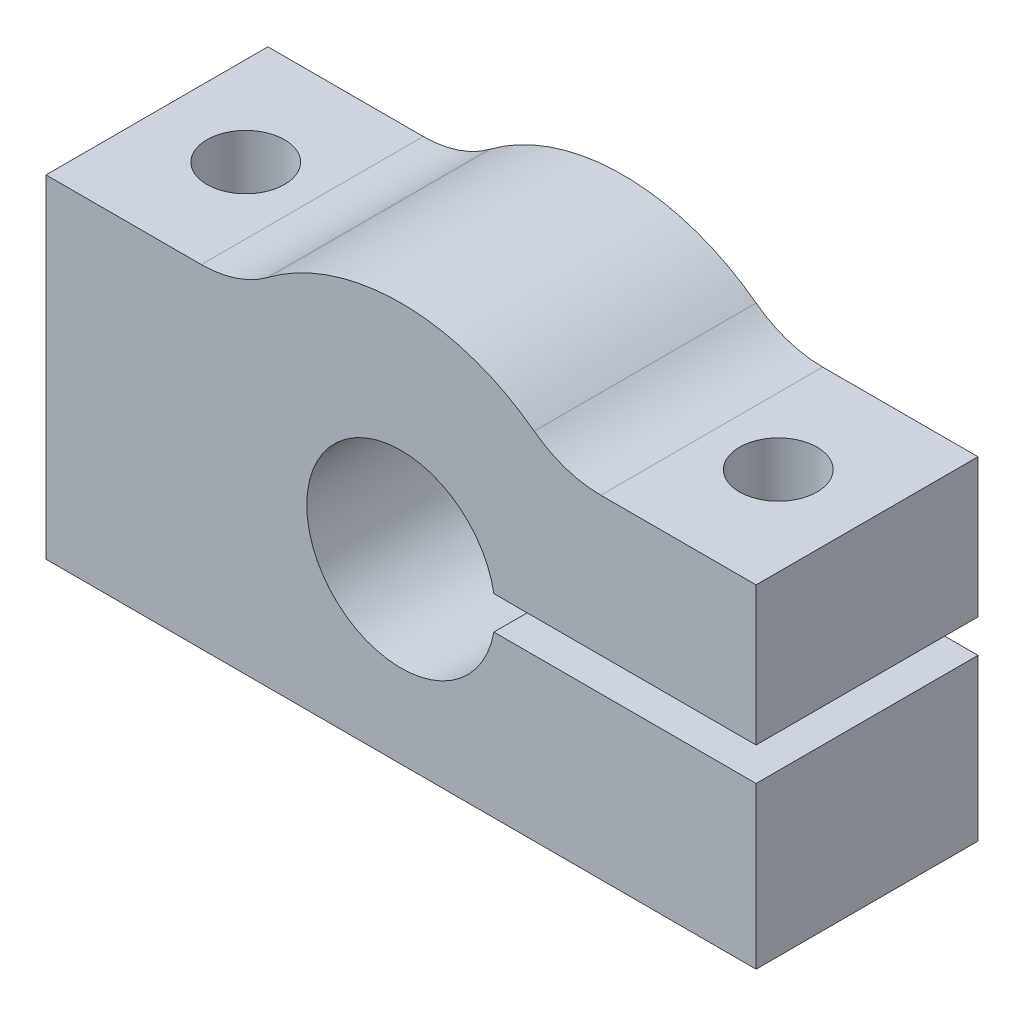
ISO-10303-21;
HEADER;
FILE_DESCRIPTION(('STEP AP214'),'2;1');
FILE_NAME('part.step','',(''),(''),'','','');
FILE_SCHEMA(('AUTOMOTIVE_DESIGN { 1 0 10303 214 1 1 1 1 }'));
ENDSEC;
DATA;
#1=APPLICATION_CONTEXT('core data for automotive mechanical design processes');
#2=APPLICATION_PROTOCOL_DEFINITION('international standard','automotive_design',2000,#1);
#3=PRODUCT_CONTEXT('',#1,'mechanical');
#4=PRODUCT('Part','Part','',(#3));
#5=PRODUCT_RELATED_PRODUCT_CATEGORY('part','',(#4));
#6=PRODUCT_DEFINITION_FORMATION('','',#4);
#7=PRODUCT_DEFINITION_CONTEXT('part definition',#1,'design');
#8=PRODUCT_DEFINITION('design','',#6,#7);
#9=PRODUCT_DEFINITION_SHAPE('','',#8);
#10=(LENGTH_UNIT() NAMED_UNIT(*) SI_UNIT(.MILLI.,.METRE.));
#11=(NAMED_UNIT(*) PLANE_ANGLE_UNIT() SI_UNIT($,.RADIAN.));
#12=(NAMED_UNIT(*) SI_UNIT($,.STERADIAN.) SOLID_ANGLE_UNIT());
#13=UNCERTAINTY_MEASURE_WITH_UNIT(LENGTH_MEASURE(1.E-05),#10,'distance_accuracy_value','');
#14=(GEOMETRIC_REPRESENTATION_CONTEXT(3) GLOBAL_UNCERTAINTY_ASSIGNED_CONTEXT((#13)) GLOBAL_UNIT_ASSIGNED_CONTEXT((#10,
#11,#12)) REPRESENTATION_CONTEXT('',''));
#15=CARTESIAN_POINT('',(0.,0.,0.));
#16=DIRECTION('',(0.,0.,1.));
#17=DIRECTION('',(1.,0.,0.));
#18=AXIS2_PLACEMENT_3D('',#15,#16,#17);
#19=CARTESIAN_POINT('',(7.14142842854285,15.,-5.));
#20=DIRECTION('',(0.,1.,0.));
#21=DIRECTION('',(0.,0.,1.));
#22=AXIS2_PLACEMENT_3D('',#19,#20,#21);
#23=PLANE('',#22);
#24=CARTESIAN_POINT('',(12.,15.,0.));
#25=DIRECTION('',(0.,1.,0.));
#26=DIRECTION('',(0.,0.,1.));
#27=AXIS2_PLACEMENT_3D('',#24,#25,#26);
#28=CIRCLE('',#27,1.75);
#29=CARTESIAN_POINT('',(12.,15.,1.75));
#30=VERTEX_POINT('',#29);
#31=EDGE_CURVE('E317',#30,#30,#28,.T.);
#32=ORIENTED_EDGE('',*,*,#31,.F.);
#33=EDGE_LOOP('',(#32));
#34=FACE_BOUND('',#33,.T.);
#35=DIRECTION('',(-1.,0.,0.));
#36=VECTOR('',#35,1.);
#37=CARTESIAN_POINT('',(7.14142842854285,15.,-5.));
#38=LINE('',#37,#36);
#39=CARTESIAN_POINT('',(16.,15.,-5.));
#40=VERTEX_POINT('',#39);
#41=CARTESIAN_POINT('',(9.00000000000001,15.,-5.));
#42=VERTEX_POINT('',#41);
#43=EDGE_CURVE('E169',#40,#42,#38,.T.);
#44=ORIENTED_EDGE('',*,*,#43,.T.);
#45=DIRECTION('',(0.,0.,-1.));
#46=VECTOR('',#45,1.);
#47=CARTESIAN_POINT('',(9.00000000000001,15.,5.));
#48=LINE('',#47,#46);
#49=CARTESIAN_POINT('',(9.00000000000001,15.,5.));
#50=VERTEX_POINT('',#49);
#51=EDGE_CURVE('E219',#42,#50,#48,.F.);
#52=ORIENTED_EDGE('',*,*,#51,.T.);
#53=DIRECTION('',(-1.,0.,0.));
#54=VECTOR('',#53,1.);
#55=CARTESIAN_POINT('',(7.14142842854285,15.,5.));
#56=LINE('',#55,#54);
#57=CARTESIAN_POINT('',(16.,15.,5.));
#58=VERTEX_POINT('',#57);
#59=EDGE_CURVE('E211',#58,#50,#56,.T.);
#60=ORIENTED_EDGE('',*,*,#59,.F.);
#61=DIRECTION('',(0.,0.,1.));
#62=VECTOR('',#61,1.);
#63=CARTESIAN_POINT('',(16.,15.,-5.));
#64=LINE('',#63,#62);
#65=EDGE_CURVE('E194',#40,#58,#64,.T.);
#66=ORIENTED_EDGE('',*,*,#65,.F.);
#67=EDGE_LOOP('',(#44,#52,#60,#66));
#68=FACE_BOUND('',#67,.T.);
#69=ADVANCED_FACE('F34',(#34,#68),#23,.T.);
#70=CARTESIAN_POINT('',(16.,8.75,-5.));
#71=DIRECTION('',(1.,0.,0.));
#72=DIRECTION('',(0.,1.,0.));
#73=AXIS2_PLACEMENT_3D('',#70,#71,#72);
#74=PLANE('',#73);
#75=ORIENTED_EDGE('',*,*,#65,.T.);
#76=DIRECTION('',(0.,1.,0.));
#77=VECTOR('',#76,1.);
#78=CARTESIAN_POINT('',(16.,8.75,5.));
#79=LINE('',#78,#77);
#80=CARTESIAN_POINT('',(16.,8.75,5.));
#81=VERTEX_POINT('',#80);
#82=EDGE_CURVE('E166',#81,#58,#79,.T.);
#83=ORIENTED_EDGE('',*,*,#82,.F.);
#84=DIRECTION('',(0.,0.,1.));
#85=VECTOR('',#84,1.);
#86=CARTESIAN_POINT('',(16.,8.75,-5.));
#87=LINE('',#86,#85);
#88=CARTESIAN_POINT('',(16.,8.75,-5.));
#89=VERTEX_POINT('',#88);
#90=EDGE_CURVE('E197',#89,#81,#87,.T.);
#91=ORIENTED_EDGE('',*,*,#90,.F.);
#92=DIRECTION('',(0.,1.,0.));
#93=VECTOR('',#92,1.);
#94=CARTESIAN_POINT('',(16.,8.75,-5.));
#95=LINE('',#94,#93);
#96=EDGE_CURVE('E146',#89,#40,#95,.T.);
#97=ORIENTED_EDGE('',*,*,#96,.T.);
#98=EDGE_LOOP('',(#75,#83,#91,#97));
#99=FACE_BOUND('',#98,.T.);
#100=ADVANCED_FACE('F233',(#99),#74,.T.);
#101=CARTESIAN_POINT('',(4.18330013267038,8.75,-5.));
#102=DIRECTION('',(0.,-1.,0.));
#103=DIRECTION('',(0.,0.,-1.));
#104=AXIS2_PLACEMENT_3D('',#101,#102,#103);
#105=PLANE('',#104);
#106=CARTESIAN_POINT('',(12.,8.75,0.));
#107=DIRECTION('',(0.,-1.,0.));
#108=DIRECTION('',(0.,0.,-1.));
#109=AXIS2_PLACEMENT_3D('',#106,#107,#108);
#110=CIRCLE('',#109,1.75);
#111=CARTESIAN_POINT('',(12.,8.75,-1.75));
#112=VERTEX_POINT('',#111);
#113=EDGE_CURVE('E313',#112,#112,#110,.T.);
#114=ORIENTED_EDGE('',*,*,#113,.F.);
#115=EDGE_LOOP('',(#114));
#116=FACE_BOUND('',#115,.T.);
#117=ORIENTED_EDGE('',*,*,#90,.T.);
#118=DIRECTION('',(1.,0.,0.));
#119=VECTOR('',#118,1.);
#120=CARTESIAN_POINT('',(4.18330013267038,8.75,5.));
#121=LINE('',#120,#119);
#122=CARTESIAN_POINT('',(4.18330013267038,8.75,5.));
#123=VERTEX_POINT('',#122);
#124=EDGE_CURVE('E163',#123,#81,#121,.T.);
#125=ORIENTED_EDGE('',*,*,#124,.F.);
#126=DIRECTION('',(0.,0.,1.));
#127=VECTOR('',#126,1.);
#128=CARTESIAN_POINT('',(4.18330013267038,8.75,-5.));
#129=LINE('',#128,#127);
#130=CARTESIAN_POINT('',(4.18330013267038,8.75,-5.));
#131=VERTEX_POINT('',#130);
#132=EDGE_CURVE('E199',#131,#123,#129,.T.);
#133=ORIENTED_EDGE('',*,*,#132,.F.);
#134=DIRECTION('',(1.,0.,0.));
#135=VECTOR('',#134,1.);
#136=CARTESIAN_POINT('',(4.18330013267038,8.75,-5.));
#137=LINE('',#136,#135);
#138=EDGE_CURVE('E189',#131,#89,#137,.T.);
#139=ORIENTED_EDGE('',*,*,#138,.T.);
#140=EDGE_LOOP('',(#117,#125,#133,#139));
#141=FACE_BOUND('',#140,.T.);
#142=ADVANCED_FACE('F237',(#116,#141),#105,.T.);
#143=CARTESIAN_POINT('',(0.,8.,-5.));
#144=DIRECTION('',(0.,0.,1.));
#145=DIRECTION('',(1.,0.,0.));
#146=AXIS2_PLACEMENT_3D('',#143,#144,#145);
#147=CYLINDRICAL_SURFACE('',#146,4.25);
#148=ORIENTED_EDGE('',*,*,#132,.T.);
#149=CARTESIAN_POINT('',(0.,8.,5.));
#150=DIRECTION('',(0.,0.,-1.));
#151=DIRECTION('',(1.,0.,0.));
#152=AXIS2_PLACEMENT_3D('',#149,#150,#151);
#153=CIRCLE('',#152,4.25);
#154=CARTESIAN_POINT('',(4.18330013267038,7.25,5.));
#155=VERTEX_POINT('',#154);
#156=EDGE_CURVE('E160',#155,#123,#153,.T.);
#157=ORIENTED_EDGE('',*,*,#156,.F.);
#158=DIRECTION('',(0.,0.,1.));
#159=VECTOR('',#158,1.);
#160=CARTESIAN_POINT('',(4.18330013267038,7.25,-5.));
#161=LINE('',#160,#159);
#162=CARTESIAN_POINT('',(4.18330013267038,7.25,-5.));
#163=VERTEX_POINT('',#162);
#164=EDGE_CURVE('E201',#163,#155,#161,.T.);
#165=ORIENTED_EDGE('',*,*,#164,.F.);
#166=CARTESIAN_POINT('',(0.,8.,-5.));
#167=DIRECTION('',(0.,0.,-1.));
#168=DIRECTION('',(1.,0.,0.));
#169=AXIS2_PLACEMENT_3D('',#166,#167,#168);
#170=CIRCLE('',#169,4.25);
#171=EDGE_CURVE('E186',#163,#131,#170,.T.);
#172=ORIENTED_EDGE('',*,*,#171,.T.);
#173=EDGE_LOOP('',(#148,#157,#165,#172));
#174=FACE_BOUND('',#173,.T.);
#175=ADVANCED_FACE('F241',(#174),#147,.F.);
#176=CARTESIAN_POINT('',(4.18330013267038,7.25,-5.));
#177=DIRECTION('',(0.,1.,0.));
#178=DIRECTION('',(0.,0.,1.));
#179=AXIS2_PLACEMENT_3D('',#176,#177,#178);
#180=PLANE('',#179);
#181=CARTESIAN_POINT('',(12.,7.25,0.));
#182=DIRECTION('',(0.,1.,0.));
#183=DIRECTION('',(0.,0.,1.));
#184=AXIS2_PLACEMENT_3D('',#181,#182,#183);
#185=CIRCLE('',#184,1.75);
#186=CARTESIAN_POINT('',(12.,7.25,1.75));
#187=VERTEX_POINT('',#186);
#188=EDGE_CURVE('E312',#187,#187,#185,.T.);
#189=ORIENTED_EDGE('',*,*,#188,.F.);
#190=EDGE_LOOP('',(#189));
#191=FACE_BOUND('',#190,.T.);
#192=ORIENTED_EDGE('',*,*,#164,.T.);
#193=DIRECTION('',(-1.,0.,0.));
#194=VECTOR('',#193,1.);
#195=CARTESIAN_POINT('',(4.18330013267038,7.25,5.));
#196=LINE('',#195,#194);
#197=CARTESIAN_POINT('',(16.,7.25,5.));
#198=VERTEX_POINT('',#197);
#199=EDGE_CURVE('E157',#198,#155,#196,.T.);
#200=ORIENTED_EDGE('',*,*,#199,.F.);
#201=DIRECTION('',(0.,0.,1.));
#202=VECTOR('',#201,1.);
#203=CARTESIAN_POINT('',(16.,7.25,-5.));
#204=LINE('',#203,#202);
#205=CARTESIAN_POINT('',(16.,7.25,-5.));
#206=VERTEX_POINT('',#205);
#207=EDGE_CURVE('E203',#206,#198,#204,.T.);
#208=ORIENTED_EDGE('',*,*,#207,.F.);
#209=DIRECTION('',(-1.,0.,0.));
#210=VECTOR('',#209,1.);
#211=CARTESIAN_POINT('',(4.18330013267038,7.25,-5.));
#212=LINE('',#211,#210);
#213=EDGE_CURVE('E183',#206,#163,#212,.T.);
#214=ORIENTED_EDGE('',*,*,#213,.T.);
#215=EDGE_LOOP('',(#192,#200,#208,#214));
#216=FACE_BOUND('',#215,.T.);
#217=ADVANCED_FACE('F245',(#191,#216),#180,.T.);
#218=CARTESIAN_POINT('',(16.,0.,-5.));
#219=DIRECTION('',(1.,0.,0.));
#220=DIRECTION('',(0.,1.,0.));
#221=AXIS2_PLACEMENT_3D('',#218,#219,#220);
#222=PLANE('',#221);
#223=ORIENTED_EDGE('',*,*,#207,.T.);
#224=DIRECTION('',(0.,1.,0.));
#225=VECTOR('',#224,1.);
#226=CARTESIAN_POINT('',(16.,0.,5.));
#227=LINE('',#226,#225);
#228=CARTESIAN_POINT('',(16.,0.,5.));
#229=VERTEX_POINT('',#228);
#230=EDGE_CURVE('E151',#229,#198,#227,.T.);
#231=ORIENTED_EDGE('',*,*,#230,.F.);
#232=DIRECTION('',(0.,0.,1.));
#233=VECTOR('',#232,1.);
#234=CARTESIAN_POINT('',(16.,0.,-5.));
#235=LINE('',#234,#233);
#236=CARTESIAN_POINT('',(16.,0.,-5.));
#237=VERTEX_POINT('',#236);
#238=EDGE_CURVE('E205',#237,#229,#235,.T.);
#239=ORIENTED_EDGE('',*,*,#238,.F.);
#240=DIRECTION('',(0.,1.,0.));
#241=VECTOR('',#240,1.);
#242=CARTESIAN_POINT('',(16.,0.,-5.));
#243=LINE('',#242,#241);
#244=EDGE_CURVE('E180',#237,#206,#243,.T.);
#245=ORIENTED_EDGE('',*,*,#244,.T.);
#246=EDGE_LOOP('',(#223,#231,#239,#245));
#247=FACE_BOUND('',#246,.T.);
#248=ADVANCED_FACE('F248',(#247),#222,.T.);
#249=CARTESIAN_POINT('',(-16.,0.,-5.));
#250=DIRECTION('',(0.,-1.,0.));
#251=DIRECTION('',(1.,0.,0.));
#252=AXIS2_PLACEMENT_3D('',#249,#250,#251);
#253=PLANE('',#252);
#254=CARTESIAN_POINT('',(12.,0.,0.));
#255=DIRECTION('',(0.,-1.,0.));
#256=DIRECTION('',(1.,0.,0.));
#257=AXIS2_PLACEMENT_3D('',#254,#255,#256);
#258=CIRCLE('',#257,1.75);
#259=CARTESIAN_POINT('',(13.75,0.,0.));
#260=VERTEX_POINT('',#259);
#261=EDGE_CURVE('E314',#260,#260,#258,.T.);
#262=ORIENTED_EDGE('',*,*,#261,.F.);
#263=EDGE_LOOP('',(#262));
#264=FACE_BOUND('',#263,.T.);
#265=CARTESIAN_POINT('',(-12.,0.,0.));
#266=DIRECTION('',(0.,-1.,0.));
#267=DIRECTION('',(1.,0.,0.));
#268=AXIS2_PLACEMENT_3D('',#265,#266,#267);
#269=CIRCLE('',#268,1.75);
#270=CARTESIAN_POINT('',(-10.25,0.,0.));
#271=VERTEX_POINT('',#270);
#272=EDGE_CURVE('E212',#271,#271,#269,.T.);
#273=ORIENTED_EDGE('',*,*,#272,.F.);
#274=EDGE_LOOP('',(#273));
#275=FACE_BOUND('',#274,.T.);
#276=ORIENTED_EDGE('',*,*,#238,.T.);
#277=DIRECTION('',(1.,0.,0.));
#278=VECTOR('',#277,1.);
#279=CARTESIAN_POINT('',(-16.,0.,5.));
#280=LINE('',#279,#278);
#281=CARTESIAN_POINT('',(-16.,0.,5.));
#282=VERTEX_POINT('',#281);
#283=EDGE_CURVE('E149',#282,#229,#280,.T.);
#284=ORIENTED_EDGE('',*,*,#283,.F.);
#285=DIRECTION('',(0.,0.,1.));
#286=VECTOR('',#285,1.);
#287=CARTESIAN_POINT('',(-16.,0.,-5.));
#288=LINE('',#287,#286);
#289=CARTESIAN_POINT('',(-16.,0.,-5.));
#290=VERTEX_POINT('',#289);
#291=EDGE_CURVE('E145',#290,#282,#288,.T.);
#292=ORIENTED_EDGE('',*,*,#291,.F.);
#293=DIRECTION('',(1.,0.,0.));
#294=VECTOR('',#293,1.);
#295=CARTESIAN_POINT('',(-16.,0.,-5.));
#296=LINE('',#295,#294);
#297=EDGE_CURVE('E177',#290,#237,#296,.T.);
#298=ORIENTED_EDGE('',*,*,#297,.T.);
#299=EDGE_LOOP('',(#276,#284,#292,#298));
#300=FACE_BOUND('',#299,.T.);
#301=ADVANCED_FACE('F252',(#264,#275,#300),#253,.T.);
#302=CARTESIAN_POINT('',(-16.,0.,-5.));
#303=DIRECTION('',(-1.,0.,0.));
#304=DIRECTION('',(0.,-1.,0.));
#305=AXIS2_PLACEMENT_3D('',#302,#303,#304);
#306=PLANE('',#305);
#307=ORIENTED_EDGE('',*,*,#291,.T.);
#308=DIRECTION('',(0.,-1.,0.));
#309=VECTOR('',#308,1.);
#310=CARTESIAN_POINT('',(-16.,0.,5.));
#311=LINE('',#310,#309);
#312=CARTESIAN_POINT('',(-16.,15.,5.));
#313=VERTEX_POINT('',#312);
#314=EDGE_CURVE('E129',#313,#282,#311,.T.);
#315=ORIENTED_EDGE('',*,*,#314,.F.);
#316=DIRECTION('',(0.,0.,1.));
#317=VECTOR('',#316,1.);
#318=CARTESIAN_POINT('',(-16.,15.,-5.));
#319=LINE('',#318,#317);
#320=CARTESIAN_POINT('',(-16.,15.,-5.));
#321=VERTEX_POINT('',#320);
#322=EDGE_CURVE('E138',#321,#313,#319,.T.);
#323=ORIENTED_EDGE('',*,*,#322,.F.);
#324=DIRECTION('',(0.,-1.,0.));
#325=VECTOR('',#324,1.);
#326=CARTESIAN_POINT('',(-16.,0.,-5.));
#327=LINE('',#326,#325);
#328=EDGE_CURVE('E175',#321,#290,#327,.T.);
#329=ORIENTED_EDGE('',*,*,#328,.T.);
#330=EDGE_LOOP('',(#307,#315,#323,#329));
#331=FACE_BOUND('',#330,.T.);
#332=ADVANCED_FACE('F148',(#331),#306,.T.);
#333=CARTESIAN_POINT('',(-16.,15.,-5.));
#334=DIRECTION('',(0.,1.,0.));
#335=DIRECTION('',(0.,0.,1.));
#336=AXIS2_PLACEMENT_3D('',#333,#334,#335);
#337=PLANE('',#336);
#338=CARTESIAN_POINT('',(-12.,15.,0.));
#339=DIRECTION('',(0.,1.,0.));
#340=DIRECTION('',(0.,0.,1.));
#341=AXIS2_PLACEMENT_3D('',#338,#339,#340);
#342=CIRCLE('',#341,1.75);
#343=CARTESIAN_POINT('',(-12.,15.,1.75));
#344=VERTEX_POINT('',#343);
#345=EDGE_CURVE('E208',#344,#344,#342,.T.);
#346=ORIENTED_EDGE('',*,*,#345,.F.);
#347=EDGE_LOOP('',(#346));
#348=FACE_BOUND('',#347,.T.);
#349=DIRECTION('',(-1.,0.,0.));
#350=VECTOR('',#349,1.);
#351=CARTESIAN_POINT('',(-16.,15.,5.));
#352=LINE('',#351,#350);
#353=CARTESIAN_POINT('',(-9.00000000000001,15.,5.));
#354=VERTEX_POINT('',#353);
#355=EDGE_CURVE('E123',#354,#313,#352,.T.);
#356=ORIENTED_EDGE('',*,*,#355,.F.);
#357=DIRECTION('',(0.,0.,-1.));
#358=VECTOR('',#357,1.);
#359=CARTESIAN_POINT('',(-9.00000000000001,15.,-5.));
#360=LINE('',#359,#358);
#361=CARTESIAN_POINT('',(-9.00000000000001,15.,-5.));
#362=VERTEX_POINT('',#361);
#363=EDGE_CURVE('E217',#354,#362,#360,.T.);
#364=ORIENTED_EDGE('',*,*,#363,.T.);
#365=DIRECTION('',(-1.,0.,0.));
#366=VECTOR('',#365,1.);
#367=CARTESIAN_POINT('',(-16.,15.,-5.));
#368=LINE('',#367,#366);
#369=EDGE_CURVE('E141',#362,#321,#368,.T.);
#370=ORIENTED_EDGE('',*,*,#369,.T.);
#371=ORIENTED_EDGE('',*,*,#322,.T.);
#372=EDGE_LOOP('',(#356,#364,#370,#371));
#373=FACE_BOUND('',#372,.T.);
#374=ADVANCED_FACE('F139',(#348,#373),#337,.T.);
#375=CARTESIAN_POINT('',(0.,8.,-5.));
#376=DIRECTION('',(0.,0.,1.));
#377=DIRECTION('',(1.,0.,0.));
#378=AXIS2_PLACEMENT_3D('',#375,#376,#377);
#379=CYLINDRICAL_SURFACE('',#378,10.);
#380=CARTESIAN_POINT('',(0.,8.,-5.));
#381=DIRECTION('',(0.,0.,1.));
#382=DIRECTION('',(1.,0.,0.));
#383=AXIS2_PLACEMENT_3D('',#380,#381,#382);
#384=CIRCLE('',#383,10.);
#385=CARTESIAN_POINT('',(6.,16.,-5.));
#386=VERTEX_POINT('',#385);
#387=CARTESIAN_POINT('',(-6.,16.,-5.));
#388=VERTEX_POINT('',#387);
#389=EDGE_CURVE('E171',#386,#388,#384,.T.);
#390=ORIENTED_EDGE('',*,*,#389,.T.);
#391=DIRECTION('',(0.,0.,1.));
#392=VECTOR('',#391,1.);
#393=CARTESIAN_POINT('',(-6.,16.,-5.));
#394=LINE('',#393,#392);
#395=CARTESIAN_POINT('',(-6.,16.,5.));
#396=VERTEX_POINT('',#395);
#397=EDGE_CURVE('E214',#388,#396,#394,.T.);
#398=ORIENTED_EDGE('',*,*,#397,.T.);
#399=CARTESIAN_POINT('',(0.,8.,5.));
#400=DIRECTION('',(0.,0.,1.));
#401=DIRECTION('',(1.,0.,0.));
#402=AXIS2_PLACEMENT_3D('',#399,#400,#401);
#403=CIRCLE('',#402,10.);
#404=CARTESIAN_POINT('',(6.,16.,5.));
#405=VERTEX_POINT('',#404);
#406=EDGE_CURVE('E135',#405,#396,#403,.T.);
#407=ORIENTED_EDGE('',*,*,#406,.F.);
#408=DIRECTION('',(0.,0.,1.));
#409=VECTOR('',#408,1.);
#410=CARTESIAN_POINT('',(6.,16.,-5.));
#411=LINE('',#410,#409);
#412=EDGE_CURVE('E196',#405,#386,#411,.F.);
#413=ORIENTED_EDGE('',*,*,#412,.T.);
#414=EDGE_LOOP('',(#390,#398,#407,#413));
#415=FACE_BOUND('',#414,.T.);
#416=ADVANCED_FACE('F226',(#415),#379,.T.);
#417=CARTESIAN_POINT('',(0.,8.,-5.));
#418=DIRECTION('',(0.,0.,1.));
#419=DIRECTION('',(1.,0.,0.));
#420=AXIS2_PLACEMENT_3D('',#417,#418,#419);
#421=PLANE('',#420);
#422=ORIENTED_EDGE('',*,*,#43,.F.);
#423=ORIENTED_EDGE('',*,*,#96,.F.);
#424=ORIENTED_EDGE('',*,*,#138,.F.);
#425=ORIENTED_EDGE('',*,*,#171,.F.);
#426=ORIENTED_EDGE('',*,*,#213,.F.);
#427=ORIENTED_EDGE('',*,*,#244,.F.);
#428=ORIENTED_EDGE('',*,*,#297,.F.);
#429=ORIENTED_EDGE('',*,*,#328,.F.);
#430=ORIENTED_EDGE('',*,*,#369,.F.);
#431=CARTESIAN_POINT('',(-9.00000000000001,20.,-5.));
#432=DIRECTION('',(0.,0.,1.));
#433=DIRECTION('',(1.,0.,0.));
#434=AXIS2_PLACEMENT_3D('',#431,#432,#433);
#435=CIRCLE('',#434,5.);
#436=EDGE_CURVE('E222',#362,#388,#435,.T.);
#437=ORIENTED_EDGE('',*,*,#436,.T.);
#438=ORIENTED_EDGE('',*,*,#389,.F.);
#439=CARTESIAN_POINT('',(9.00000000000001,20.,-5.));
#440=DIRECTION('',(0.,0.,1.));
#441=DIRECTION('',(1.,0.,0.));
#442=AXIS2_PLACEMENT_3D('',#439,#440,#441);
#443=CIRCLE('',#442,5.);
#444=EDGE_CURVE('E11',#386,#42,#443,.T.);
#445=ORIENTED_EDGE('',*,*,#444,.T.);
#446=EDGE_LOOP('',(#422,#423,#424,#425,#426,#427,#428,#429,#430,#437,#438,#445));
#447=FACE_BOUND('',#446,.T.);
#448=ADVANCED_FACE('F230',(#447),#421,.F.);
#449=CARTESIAN_POINT('',(0.,8.,5.));
#450=DIRECTION('',(0.,0.,1.));
#451=DIRECTION('',(1.,0.,0.));
#452=AXIS2_PLACEMENT_3D('',#449,#450,#451);
#453=PLANE('',#452);
#454=ORIENTED_EDGE('',*,*,#59,.T.);
#455=CARTESIAN_POINT('',(9.00000000000001,20.,5.));
#456=DIRECTION('',(0.,0.,1.));
#457=DIRECTION('',(1.,0.,0.));
#458=AXIS2_PLACEMENT_3D('',#455,#456,#457);
#459=CIRCLE('',#458,5.);
#460=EDGE_CURVE('E42',#50,#405,#459,.F.);
#461=ORIENTED_EDGE('',*,*,#460,.T.);
#462=ORIENTED_EDGE('',*,*,#406,.T.);
#463=CARTESIAN_POINT('',(-9.00000000000001,20.,5.));
#464=DIRECTION('',(0.,0.,1.));
#465=DIRECTION('',(1.,0.,0.));
#466=AXIS2_PLACEMENT_3D('',#463,#464,#465);
#467=CIRCLE('',#466,5.);
#468=EDGE_CURVE('E132',#396,#354,#467,.F.);
#469=ORIENTED_EDGE('',*,*,#468,.T.);
#470=ORIENTED_EDGE('',*,*,#355,.T.);
#471=ORIENTED_EDGE('',*,*,#314,.T.);
#472=ORIENTED_EDGE('',*,*,#283,.T.);
#473=ORIENTED_EDGE('',*,*,#230,.T.);
#474=ORIENTED_EDGE('',*,*,#199,.T.);
#475=ORIENTED_EDGE('',*,*,#156,.T.);
#476=ORIENTED_EDGE('',*,*,#124,.T.);
#477=ORIENTED_EDGE('',*,*,#82,.T.);
#478=EDGE_LOOP('',(#454,#461,#462,#469,#470,#471,#472,#473,#474,#475,#476,#477));
#479=FACE_BOUND('',#478,.T.);
#480=ADVANCED_FACE('F126',(#479),#453,.T.);
#481=CARTESIAN_POINT('',(-12.,18.,0.));
#482=DIRECTION('',(0.,-1.,0.));
#483=DIRECTION('',(1.,0.,0.));
#484=AXIS2_PLACEMENT_3D('',#481,#482,#483);
#485=CYLINDRICAL_SURFACE('',#484,1.75);
#486=ORIENTED_EDGE('',*,*,#345,.T.);
#487=EDGE_LOOP('',(#486));
#488=FACE_BOUND('',#487,.T.);
#489=ORIENTED_EDGE('',*,*,#272,.T.);
#490=EDGE_LOOP('',(#489));
#491=FACE_BOUND('',#490,.T.);
#492=ADVANCED_FACE('F289',(#488,#491),#485,.F.);
#493=CARTESIAN_POINT('',(12.,18.,0.));
#494=DIRECTION('',(0.,-1.,0.));
#495=DIRECTION('',(1.,0.,0.));
#496=AXIS2_PLACEMENT_3D('',#493,#494,#495);
#497=CYLINDRICAL_SURFACE('',#496,1.75);
#498=ORIENTED_EDGE('',*,*,#188,.T.);
#499=EDGE_LOOP('',(#498));
#500=FACE_BOUND('',#499,.T.);
#501=ORIENTED_EDGE('',*,*,#261,.T.);
#502=EDGE_LOOP('',(#501));
#503=FACE_BOUND('',#502,.T.);
#504=ADVANCED_FACE('F282',(#500,#503),#497,.F.);
#505=ORIENTED_EDGE('',*,*,#31,.T.);
#506=EDGE_LOOP('',(#505));
#507=FACE_BOUND('',#506,.T.);
#508=ORIENTED_EDGE('',*,*,#113,.T.);
#509=EDGE_LOOP('',(#508));
#510=FACE_BOUND('',#509,.T.);
#511=ADVANCED_FACE('F276',(#507,#510),#497,.F.);
#512=CARTESIAN_POINT('',(-9.00000000000001,20.,-5.));
#513=DIRECTION('',(0.,0.,1.));
#514=DIRECTION('',(1.,0.,0.));
#515=AXIS2_PLACEMENT_3D('',#512,#513,#514);
#516=CYLINDRICAL_SURFACE('',#515,5.);
#517=ORIENTED_EDGE('',*,*,#436,.F.);
#518=ORIENTED_EDGE('',*,*,#363,.F.);
#519=ORIENTED_EDGE('',*,*,#468,.F.);
#520=ORIENTED_EDGE('',*,*,#397,.F.);
#521=EDGE_LOOP('',(#517,#518,#519,#520));
#522=FACE_BOUND('',#521,.T.);
#523=ADVANCED_FACE('F274',(#522),#516,.F.);
#524=CARTESIAN_POINT('',(9.00000000000001,20.,-5.));
#525=DIRECTION('',(0.,0.,1.));
#526=DIRECTION('',(1.,0.,0.));
#527=AXIS2_PLACEMENT_3D('',#524,#525,#526);
#528=CYLINDRICAL_SURFACE('',#527,5.);
#529=ORIENTED_EDGE('',*,*,#444,.F.);
#530=ORIENTED_EDGE('',*,*,#412,.F.);
#531=ORIENTED_EDGE('',*,*,#460,.F.);
#532=ORIENTED_EDGE('',*,*,#51,.F.);
#533=EDGE_LOOP('',(#529,#530,#531,#532));
#534=FACE_BOUND('',#533,.T.);
#535=ADVANCED_FACE('F36',(#534),#528,.F.);
#536=CLOSED_SHELL('',(#69,#100,#142,#175,#217,#248,#301,#332,#374,#416,#448,#480,#492,#504,#511,
#523,#535));
#537=MANIFOLD_SOLID_BREP('B2',#536);
#538=ADVANCED_BREP_SHAPE_REPRESENTATION('',(#18,#537),#14);
#539=SHAPE_DEFINITION_REPRESENTATION(#9,#538);
ENDSEC;
END-ISO-10303-21;
